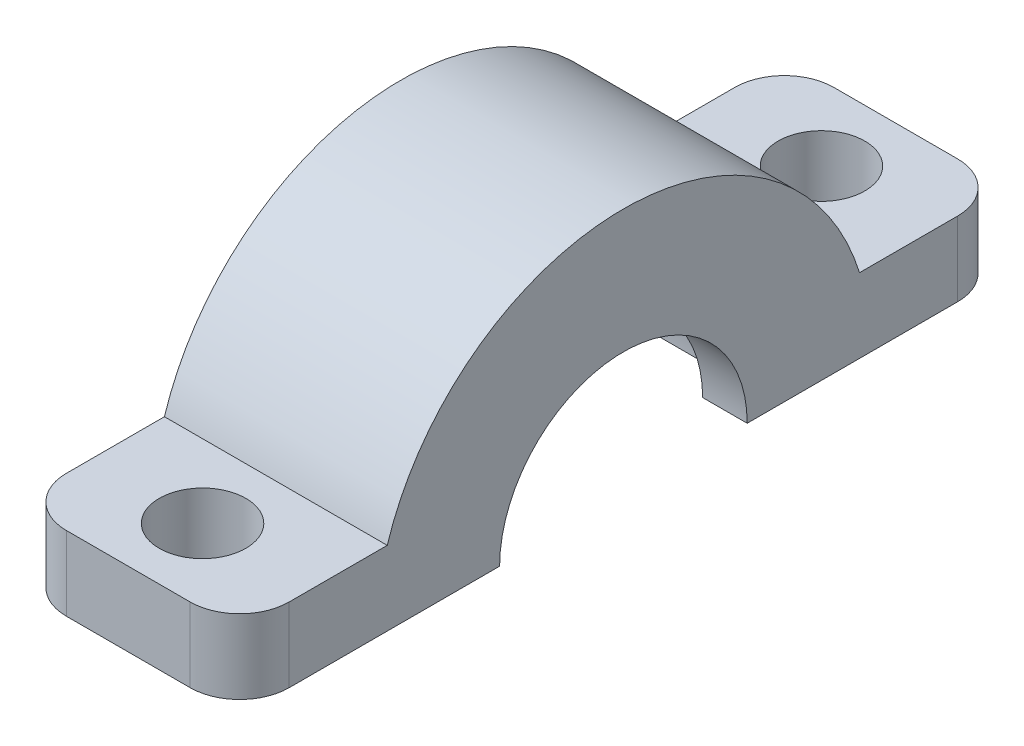
ISO-10303-21;
HEADER;
FILE_DESCRIPTION(('STEP AP214'),'2;1');
FILE_NAME('part.step','',(''),(''),'','','');
FILE_SCHEMA(('AUTOMOTIVE_DESIGN { 1 0 10303 214 1 1 1 1 }'));
ENDSEC;
DATA;
#1=APPLICATION_CONTEXT('core data for automotive mechanical design processes');
#2=APPLICATION_PROTOCOL_DEFINITION('international standard','automotive_design',2000,#1);
#3=PRODUCT_CONTEXT('',#1,'mechanical');
#4=PRODUCT('Part','Part','',(#3));
#5=PRODUCT_RELATED_PRODUCT_CATEGORY('part','',(#4));
#6=PRODUCT_DEFINITION_FORMATION('','',#4);
#7=PRODUCT_DEFINITION_CONTEXT('part definition',#1,'design');
#8=PRODUCT_DEFINITION('design','',#6,#7);
#9=PRODUCT_DEFINITION_SHAPE('','',#8);
#10=(LENGTH_UNIT() NAMED_UNIT(*) SI_UNIT(.MILLI.,.METRE.));
#11=(NAMED_UNIT(*) PLANE_ANGLE_UNIT() SI_UNIT($,.RADIAN.));
#12=(NAMED_UNIT(*) SI_UNIT($,.STERADIAN.) SOLID_ANGLE_UNIT());
#13=UNCERTAINTY_MEASURE_WITH_UNIT(LENGTH_MEASURE(1.E-05),#10,'distance_accuracy_value','');
#14=(GEOMETRIC_REPRESENTATION_CONTEXT(3) GLOBAL_UNCERTAINTY_ASSIGNED_CONTEXT((#13)) GLOBAL_UNIT_ASSIGNED_CONTEXT((#10,
#11,#12)) REPRESENTATION_CONTEXT('',''));
#15=CARTESIAN_POINT('',(0.,0.,0.));
#16=DIRECTION('',(0.,0.,1.));
#17=DIRECTION('',(1.,0.,0.));
#18=AXIS2_PLACEMENT_3D('',#15,#16,#17);
#19=CARTESIAN_POINT('',(-4.5,-1.5,0.));
#20=DIRECTION('',(1.,0.,0.));
#21=DIRECTION('',(0.,0.,-1.));
#22=AXIS2_PLACEMENT_3D('',#19,#20,#21);
#23=CYLINDRICAL_SURFACE('',#22,5.);
#24=DIRECTION('',(1.,0.,0.));
#25=VECTOR('',#24,1.);
#26=CARTESIAN_POINT('',(-4.5,-1.5,-5.));
#27=LINE('',#26,#25);
#28=CARTESIAN_POINT('',(-4.5,-1.5,-5.));
#29=VERTEX_POINT('',#28);
#30=CARTESIAN_POINT('',(-2.7,-1.5,-5.));
#31=VERTEX_POINT('',#30);
#32=EDGE_CURVE('E249',#29,#31,#27,.T.);
#33=ORIENTED_EDGE('',*,*,#32,.T.);
#34=CARTESIAN_POINT('',(-2.7,-1.5,0.));
#35=DIRECTION('',(1.,0.,0.));
#36=DIRECTION('',(0.,0.,-1.));
#37=AXIS2_PLACEMENT_3D('',#34,#35,#36);
#38=CIRCLE('',#37,5.);
#39=CARTESIAN_POINT('',(-2.7,-1.5,5.));
#40=VERTEX_POINT('',#39);
#41=EDGE_CURVE('E159',#31,#40,#38,.T.);
#42=ORIENTED_EDGE('',*,*,#41,.T.);
#43=DIRECTION('',(1.,0.,0.));
#44=VECTOR('',#43,1.);
#45=CARTESIAN_POINT('',(-4.5,-1.5,5.));
#46=LINE('',#45,#44);
#47=CARTESIAN_POINT('',(-4.5,-1.5,5.));
#48=VERTEX_POINT('',#47);
#49=EDGE_CURVE('E254',#48,#40,#46,.T.);
#50=ORIENTED_EDGE('',*,*,#49,.F.);
#51=CARTESIAN_POINT('',(-4.5,-1.5,0.));
#52=DIRECTION('',(-1.,0.,0.));
#53=DIRECTION('',(0.,0.,-1.));
#54=AXIS2_PLACEMENT_3D('',#51,#52,#53);
#55=CIRCLE('',#54,5.);
#56=EDGE_CURVE('E244',#48,#29,#55,.T.);
#57=ORIENTED_EDGE('',*,*,#56,.T.);
#58=EDGE_LOOP('',(#33,#42,#50,#57));
#59=FACE_BOUND('',#58,.T.);
#60=ADVANCED_FACE('F43',(#59),#23,.F.);
#61=CARTESIAN_POINT('',(-4.5,-1.5,-5.));
#62=DIRECTION('',(0.,-1.,0.));
#63=DIRECTION('',(0.,0.,-1.));
#64=AXIS2_PLACEMENT_3D('',#61,#62,#63);
#65=PLANE('',#64);
#66=DIRECTION('',(0.,0.,1.));
#67=VECTOR('',#66,1.);
#68=CARTESIAN_POINT('',(2.7,-1.5,-5.));
#69=LINE('',#68,#67);
#70=CARTESIAN_POINT('',(2.7,-1.5,-6.25));
#71=VERTEX_POINT('',#70);
#72=CARTESIAN_POINT('',(2.7,-1.5,-5.));
#73=VERTEX_POINT('',#72);
#74=EDGE_CURVE('E180',#71,#73,#69,.T.);
#75=ORIENTED_EDGE('',*,*,#74,.F.);
#76=DIRECTION('',(-1.,0.,0.));
#77=VECTOR('',#76,1.);
#78=CARTESIAN_POINT('',(2.7,-1.5,-6.25));
#79=LINE('',#78,#77);
#80=CARTESIAN_POINT('',(-2.7,-1.5,-6.25));
#81=VERTEX_POINT('',#80);
#82=EDGE_CURVE('E169',#71,#81,#79,.T.);
#83=ORIENTED_EDGE('',*,*,#82,.T.);
#84=DIRECTION('',(0.,0.,1.));
#85=VECTOR('',#84,1.);
#86=CARTESIAN_POINT('',(-2.7,-1.5,-5.));
#87=LINE('',#86,#85);
#88=EDGE_CURVE('E156',#81,#31,#87,.T.);
#89=ORIENTED_EDGE('',*,*,#88,.T.);
#90=ORIENTED_EDGE('',*,*,#32,.F.);
#91=DIRECTION('',(0.,0.,-1.));
#92=VECTOR('',#91,1.);
#93=CARTESIAN_POINT('',(-4.5,-1.5,-5.));
#94=LINE('',#93,#92);
#95=CARTESIAN_POINT('',(-4.5,-1.5,-13.5));
#96=VERTEX_POINT('',#95);
#97=EDGE_CURVE('E226',#29,#96,#94,.T.);
#98=ORIENTED_EDGE('',*,*,#97,.T.);
#99=CARTESIAN_POINT('',(-2.5,-1.5,-13.5));
#100=DIRECTION('',(0.,-1.,0.));
#101=DIRECTION('',(0.,0.,-1.));
#102=AXIS2_PLACEMENT_3D('',#99,#100,#101);
#103=CIRCLE('',#102,2.);
#104=CARTESIAN_POINT('',(-2.5,-1.5,-15.5));
#105=VERTEX_POINT('',#104);
#106=EDGE_CURVE('E323',#96,#105,#103,.T.);
#107=ORIENTED_EDGE('',*,*,#106,.T.);
#108=DIRECTION('',(1.,0.,0.));
#109=VECTOR('',#108,1.);
#110=CARTESIAN_POINT('',(-4.5,-1.5,-15.5));
#111=LINE('',#110,#109);
#112=CARTESIAN_POINT('',(2.5,-1.5,-15.5));
#113=VERTEX_POINT('',#112);
#114=EDGE_CURVE('E248',#105,#113,#111,.T.);
#115=ORIENTED_EDGE('',*,*,#114,.T.);
#116=CARTESIAN_POINT('',(2.5,-1.5,-13.5));
#117=DIRECTION('',(0.,-1.,0.));
#118=DIRECTION('',(0.,0.,-1.));
#119=AXIS2_PLACEMENT_3D('',#116,#117,#118);
#120=CIRCLE('',#119,2.);
#121=CARTESIAN_POINT('',(4.5,-1.5,-13.5));
#122=VERTEX_POINT('',#121);
#123=EDGE_CURVE('E326',#113,#122,#120,.T.);
#124=ORIENTED_EDGE('',*,*,#123,.T.);
#125=DIRECTION('',(0.,0.,-1.));
#126=VECTOR('',#125,1.);
#127=CARTESIAN_POINT('',(4.5,-1.5,-5.));
#128=LINE('',#127,#126);
#129=CARTESIAN_POINT('',(4.5,-1.5,-5.));
#130=VERTEX_POINT('',#129);
#131=EDGE_CURVE('E196',#130,#122,#128,.T.);
#132=ORIENTED_EDGE('',*,*,#131,.F.);
#133=EDGE_CURVE('E253',#73,#130,#27,.T.);
#134=ORIENTED_EDGE('',*,*,#133,.F.);
#135=EDGE_LOOP('',(#75,#83,#89,#90,#98,#107,#115,#124,#132,#134));
#136=FACE_BOUND('',#135,.T.);
#137=CARTESIAN_POINT('',(0.,-1.5,-12.5));
#138=DIRECTION('',(0.,1.,0.));
#139=DIRECTION('',(0.,0.,1.));
#140=AXIS2_PLACEMENT_3D('',#137,#138,#139);
#141=CIRCLE('',#140,1.75);
#142=CARTESIAN_POINT('',(0.,-1.5,-10.75));
#143=VERTEX_POINT('',#142);
#144=EDGE_CURVE('E192',#143,#143,#141,.T.);
#145=ORIENTED_EDGE('',*,*,#144,.T.);
#146=EDGE_LOOP('',(#145));
#147=FACE_BOUND('',#146,.T.);
#148=ADVANCED_FACE('F177',(#136,#147),#65,.T.);
#149=CARTESIAN_POINT('',(2.7,-1.5,0.));
#150=DIRECTION('',(1.,0.,0.));
#151=DIRECTION('',(0.,0.,-1.));
#152=AXIS2_PLACEMENT_3D('',#149,#150,#151);
#153=CIRCLE('',#152,5.);
#154=CARTESIAN_POINT('',(2.7,-1.5,5.));
#155=VERTEX_POINT('',#154);
#156=EDGE_CURVE('E164',#73,#155,#153,.T.);
#157=ORIENTED_EDGE('',*,*,#156,.F.);
#158=ORIENTED_EDGE('',*,*,#133,.T.);
#159=CARTESIAN_POINT('',(4.5,-1.5,0.));
#160=DIRECTION('',(-1.,0.,0.));
#161=DIRECTION('',(0.,0.,-1.));
#162=AXIS2_PLACEMENT_3D('',#159,#160,#161);
#163=CIRCLE('',#162,5.);
#164=CARTESIAN_POINT('',(4.5,-1.5,5.));
#165=VERTEX_POINT('',#164);
#166=EDGE_CURVE('E222',#165,#130,#163,.T.);
#167=ORIENTED_EDGE('',*,*,#166,.F.);
#168=EDGE_CURVE('E258',#155,#165,#46,.T.);
#169=ORIENTED_EDGE('',*,*,#168,.F.);
#170=EDGE_LOOP('',(#157,#158,#167,#169));
#171=FACE_BOUND('',#170,.T.);
#172=ADVANCED_FACE('F349',(#171),#23,.F.);
#173=CARTESIAN_POINT('',(-4.5,-1.5,15.5));
#174=DIRECTION('',(0.,-1.,0.));
#175=DIRECTION('',(0.,0.,-1.));
#176=AXIS2_PLACEMENT_3D('',#173,#174,#175);
#177=PLANE('',#176);
#178=DIRECTION('',(0.,0.,1.));
#179=VECTOR('',#178,1.);
#180=CARTESIAN_POINT('',(2.7,-1.5,15.5));
#181=LINE('',#180,#179);
#182=CARTESIAN_POINT('',(2.7,-1.5,6.25));
#183=VERTEX_POINT('',#182);
#184=EDGE_CURVE('E11',#155,#183,#181,.T.);
#185=ORIENTED_EDGE('',*,*,#184,.F.);
#186=ORIENTED_EDGE('',*,*,#168,.T.);
#187=DIRECTION('',(0.,0.,-1.));
#188=VECTOR('',#187,1.);
#189=CARTESIAN_POINT('',(4.5,-1.5,15.5));
#190=LINE('',#189,#188);
#191=CARTESIAN_POINT('',(4.5,-1.5,13.5));
#192=VERTEX_POINT('',#191);
#193=EDGE_CURVE('E218',#192,#165,#190,.T.);
#194=ORIENTED_EDGE('',*,*,#193,.F.);
#195=CARTESIAN_POINT('',(2.5,-1.5,13.5));
#196=DIRECTION('',(0.,-1.,0.));
#197=DIRECTION('',(0.,0.,-1.));
#198=AXIS2_PLACEMENT_3D('',#195,#196,#197);
#199=CIRCLE('',#198,2.);
#200=CARTESIAN_POINT('',(2.5,-1.5,15.5));
#201=VERTEX_POINT('',#200);
#202=EDGE_CURVE('E289',#192,#201,#199,.T.);
#203=ORIENTED_EDGE('',*,*,#202,.T.);
#204=DIRECTION('',(1.,0.,0.));
#205=VECTOR('',#204,1.);
#206=CARTESIAN_POINT('',(-4.5,-1.5,15.5));
#207=LINE('',#206,#205);
#208=CARTESIAN_POINT('',(-2.5,-1.5,15.5));
#209=VERTEX_POINT('',#208);
#210=EDGE_CURVE('E259',#209,#201,#207,.T.);
#211=ORIENTED_EDGE('',*,*,#210,.F.);
#212=CARTESIAN_POINT('',(-2.5,-1.5,13.5));
#213=DIRECTION('',(0.,-1.,0.));
#214=DIRECTION('',(0.,0.,-1.));
#215=AXIS2_PLACEMENT_3D('',#212,#213,#214);
#216=CIRCLE('',#215,2.);
#217=CARTESIAN_POINT('',(-4.5,-1.5,13.5));
#218=VERTEX_POINT('',#217);
#219=EDGE_CURVE('E286',#209,#218,#216,.T.);
#220=ORIENTED_EDGE('',*,*,#219,.T.);
#221=DIRECTION('',(0.,0.,-1.));
#222=VECTOR('',#221,1.);
#223=CARTESIAN_POINT('',(-4.5,-1.5,15.5));
#224=LINE('',#223,#222);
#225=EDGE_CURVE('E241',#218,#48,#224,.T.);
#226=ORIENTED_EDGE('',*,*,#225,.T.);
#227=ORIENTED_EDGE('',*,*,#49,.T.);
#228=DIRECTION('',(0.,0.,1.));
#229=VECTOR('',#228,1.);
#230=CARTESIAN_POINT('',(-2.7,-1.5,15.5));
#231=LINE('',#230,#229);
#232=CARTESIAN_POINT('',(-2.7,-1.5,6.25));
#233=VERTEX_POINT('',#232);
#234=EDGE_CURVE('E329',#40,#233,#231,.T.);
#235=ORIENTED_EDGE('',*,*,#234,.T.);
#236=DIRECTION('',(-1.,0.,0.));
#237=VECTOR('',#236,1.);
#238=CARTESIAN_POINT('',(2.7,-1.5,6.25));
#239=LINE('',#238,#237);
#240=EDGE_CURVE('E52',#233,#183,#239,.F.);
#241=ORIENTED_EDGE('',*,*,#240,.T.);
#242=EDGE_LOOP('',(#185,#186,#194,#203,#211,#220,#226,#227,#235,#241));
#243=FACE_BOUND('',#242,.T.);
#244=CARTESIAN_POINT('',(0.,-1.5,12.5));
#245=DIRECTION('',(0.,1.,0.));
#246=DIRECTION('',(0.,0.,1.));
#247=AXIS2_PLACEMENT_3D('',#244,#245,#246);
#248=CIRCLE('',#247,1.75);
#249=CARTESIAN_POINT('',(0.,-1.5,14.25));
#250=VERTEX_POINT('',#249);
#251=EDGE_CURVE('E182',#250,#250,#248,.T.);
#252=ORIENTED_EDGE('',*,*,#251,.T.);
#253=EDGE_LOOP('',(#252));
#254=FACE_BOUND('',#253,.T.);
#255=ADVANCED_FACE('F334',(#243,#254),#177,.T.);
#256=CARTESIAN_POINT('',(-4.5,1.5,15.5));
#257=DIRECTION('',(0.,0.,1.));
#258=DIRECTION('',(1.,0.,0.));
#259=AXIS2_PLACEMENT_3D('',#256,#257,#258);
#260=PLANE('',#259);
#261=ORIENTED_EDGE('',*,*,#210,.T.);
#262=DIRECTION('',(0.,-1.,0.));
#263=VECTOR('',#262,1.);
#264=CARTESIAN_POINT('',(2.5,1.5,15.5));
#265=LINE('',#264,#263);
#266=CARTESIAN_POINT('',(2.5,1.5,15.5));
#267=VERTEX_POINT('',#266);
#268=EDGE_CURVE('E296',#201,#267,#265,.F.);
#269=ORIENTED_EDGE('',*,*,#268,.T.);
#270=DIRECTION('',(1.,0.,0.));
#271=VECTOR('',#270,1.);
#272=CARTESIAN_POINT('',(-4.5,1.5,15.5));
#273=LINE('',#272,#271);
#274=CARTESIAN_POINT('',(-2.5,1.5,15.5));
#275=VERTEX_POINT('',#274);
#276=EDGE_CURVE('E263',#275,#267,#273,.T.);
#277=ORIENTED_EDGE('',*,*,#276,.F.);
#278=DIRECTION('',(0.,-1.,0.));
#279=VECTOR('',#278,1.);
#280=CARTESIAN_POINT('',(-2.5,-1.5,15.5));
#281=LINE('',#280,#279);
#282=EDGE_CURVE('E292',#275,#209,#281,.T.);
#283=ORIENTED_EDGE('',*,*,#282,.T.);
#284=EDGE_LOOP('',(#261,#269,#277,#283));
#285=FACE_BOUND('',#284,.T.);
#286=ADVANCED_FACE('F365',(#285),#260,.T.);
#287=CARTESIAN_POINT('',(-4.5,1.5,15.5));
#288=DIRECTION('',(0.,1.,0.));
#289=DIRECTION('',(0.,0.,1.));
#290=AXIS2_PLACEMENT_3D('',#287,#288,#289);
#291=PLANE('',#290);
#292=CARTESIAN_POINT('',(0.,1.5,12.5));
#293=DIRECTION('',(0.,1.,0.));
#294=DIRECTION('',(0.,0.,1.));
#295=AXIS2_PLACEMENT_3D('',#292,#293,#294);
#296=CIRCLE('',#295,1.75);
#297=CARTESIAN_POINT('',(0.,1.5,14.25));
#298=VERTEX_POINT('',#297);
#299=EDGE_CURVE('E187',#298,#298,#296,.T.);
#300=ORIENTED_EDGE('',*,*,#299,.F.);
#301=EDGE_LOOP('',(#300));
#302=FACE_BOUND('',#301,.T.);
#303=ORIENTED_EDGE('',*,*,#276,.T.);
#304=CARTESIAN_POINT('',(2.5,1.5,13.5));
#305=DIRECTION('',(0.,1.,0.));
#306=DIRECTION('',(0.,0.,1.));
#307=AXIS2_PLACEMENT_3D('',#304,#305,#306);
#308=CIRCLE('',#307,2.);
#309=CARTESIAN_POINT('',(4.5,1.5,13.5));
#310=VERTEX_POINT('',#309);
#311=EDGE_CURVE('E302',#267,#310,#308,.T.);
#312=ORIENTED_EDGE('',*,*,#311,.T.);
#313=DIRECTION('',(0.,0.,1.));
#314=VECTOR('',#313,1.);
#315=CARTESIAN_POINT('',(4.5,1.5,15.5));
#316=LINE('',#315,#314);
#317=CARTESIAN_POINT('',(4.5,1.5,9.53939201416946));
#318=VERTEX_POINT('',#317);
#319=EDGE_CURVE('E214',#318,#310,#316,.T.);
#320=ORIENTED_EDGE('',*,*,#319,.F.);
#321=DIRECTION('',(1.,0.,0.));
#322=VECTOR('',#321,1.);
#323=CARTESIAN_POINT('',(-4.5,1.5,9.53939201416946));
#324=LINE('',#323,#322);
#325=CARTESIAN_POINT('',(-4.5,1.5,9.53939201416946));
#326=VERTEX_POINT('',#325);
#327=EDGE_CURVE('E267',#326,#318,#324,.T.);
#328=ORIENTED_EDGE('',*,*,#327,.F.);
#329=DIRECTION('',(0.,0.,1.));
#330=VECTOR('',#329,1.);
#331=CARTESIAN_POINT('',(-4.5,1.5,15.5));
#332=LINE('',#331,#330);
#333=CARTESIAN_POINT('',(-4.5,1.5,13.5));
#334=VERTEX_POINT('',#333);
#335=EDGE_CURVE('E237',#326,#334,#332,.T.);
#336=ORIENTED_EDGE('',*,*,#335,.T.);
#337=CARTESIAN_POINT('',(-2.5,1.5,13.5));
#338=DIRECTION('',(0.,1.,0.));
#339=DIRECTION('',(0.,0.,1.));
#340=AXIS2_PLACEMENT_3D('',#337,#338,#339);
#341=CIRCLE('',#340,2.);
#342=EDGE_CURVE('E299',#334,#275,#341,.T.);
#343=ORIENTED_EDGE('',*,*,#342,.T.);
#344=EDGE_LOOP('',(#303,#312,#320,#328,#336,#343));
#345=FACE_BOUND('',#344,.T.);
#346=ADVANCED_FACE('F397',(#302,#345),#291,.T.);
#347=CARTESIAN_POINT('',(-4.5,-1.5,0.));
#348=DIRECTION('',(1.,0.,0.));
#349=DIRECTION('',(0.,0.,-1.));
#350=AXIS2_PLACEMENT_3D('',#347,#348,#349);
#351=CYLINDRICAL_SURFACE('',#350,10.);
#352=ORIENTED_EDGE('',*,*,#327,.T.);
#353=CARTESIAN_POINT('',(4.5,-1.5,0.));
#354=DIRECTION('',(1.,0.,0.));
#355=DIRECTION('',(0.,0.,-1.));
#356=AXIS2_PLACEMENT_3D('',#353,#354,#355);
#357=CIRCLE('',#356,10.);
#358=CARTESIAN_POINT('',(4.5,1.5,-9.53939201416946));
#359=VERTEX_POINT('',#358);
#360=EDGE_CURVE('E210',#359,#318,#357,.T.);
#361=ORIENTED_EDGE('',*,*,#360,.F.);
#362=DIRECTION('',(1.,0.,0.));
#363=VECTOR('',#362,1.);
#364=CARTESIAN_POINT('',(-4.5,1.5,-9.53939201416946));
#365=LINE('',#364,#363);
#366=CARTESIAN_POINT('',(-4.5,1.5,-9.53939201416946));
#367=VERTEX_POINT('',#366);
#368=EDGE_CURVE('E270',#367,#359,#365,.T.);
#369=ORIENTED_EDGE('',*,*,#368,.F.);
#370=CARTESIAN_POINT('',(-4.5,-1.5,0.));
#371=DIRECTION('',(1.,0.,0.));
#372=DIRECTION('',(0.,0.,-1.));
#373=AXIS2_PLACEMENT_3D('',#370,#371,#372);
#374=CIRCLE('',#373,10.);
#375=EDGE_CURVE('E233',#367,#326,#374,.T.);
#376=ORIENTED_EDGE('',*,*,#375,.T.);
#377=EDGE_LOOP('',(#352,#361,#369,#376));
#378=FACE_BOUND('',#377,.T.);
#379=ADVANCED_FACE('F395',(#378),#351,.T.);
#380=CARTESIAN_POINT('',(-4.5,1.5,-9.53939201416946));
#381=DIRECTION('',(0.,1.,0.));
#382=DIRECTION('',(0.,0.,1.));
#383=AXIS2_PLACEMENT_3D('',#380,#381,#382);
#384=PLANE('',#383);
#385=CARTESIAN_POINT('',(0.,1.5,-12.5));
#386=DIRECTION('',(0.,1.,0.));
#387=DIRECTION('',(0.,0.,1.));
#388=AXIS2_PLACEMENT_3D('',#385,#386,#387);
#389=CIRCLE('',#388,1.75);
#390=CARTESIAN_POINT('',(0.,1.5,-10.75));
#391=VERTEX_POINT('',#390);
#392=EDGE_CURVE('E197',#391,#391,#389,.T.);
#393=ORIENTED_EDGE('',*,*,#392,.F.);
#394=EDGE_LOOP('',(#393));
#395=FACE_BOUND('',#394,.T.);
#396=DIRECTION('',(0.,0.,1.));
#397=VECTOR('',#396,1.);
#398=CARTESIAN_POINT('',(4.5,1.5,-9.53939201416946));
#399=LINE('',#398,#397);
#400=CARTESIAN_POINT('',(4.5,1.5,-13.5));
#401=VERTEX_POINT('',#400);
#402=EDGE_CURVE('E207',#401,#359,#399,.T.);
#403=ORIENTED_EDGE('',*,*,#402,.F.);
#404=CARTESIAN_POINT('',(2.5,1.5,-13.5));
#405=DIRECTION('',(0.,1.,0.));
#406=DIRECTION('',(0.,0.,1.));
#407=AXIS2_PLACEMENT_3D('',#404,#405,#406);
#408=CIRCLE('',#407,2.);
#409=CARTESIAN_POINT('',(2.5,1.5,-15.5));
#410=VERTEX_POINT('',#409);
#411=EDGE_CURVE('E314',#401,#410,#408,.T.);
#412=ORIENTED_EDGE('',*,*,#411,.T.);
#413=DIRECTION('',(1.,0.,0.));
#414=VECTOR('',#413,1.);
#415=CARTESIAN_POINT('',(-4.5,1.5,-15.5));
#416=LINE('',#415,#414);
#417=CARTESIAN_POINT('',(-2.5,1.5,-15.5));
#418=VERTEX_POINT('',#417);
#419=EDGE_CURVE('E274',#418,#410,#416,.T.);
#420=ORIENTED_EDGE('',*,*,#419,.F.);
#421=CARTESIAN_POINT('',(-2.5,1.5,-13.5));
#422=DIRECTION('',(0.,1.,0.));
#423=DIRECTION('',(0.,0.,1.));
#424=AXIS2_PLACEMENT_3D('',#421,#422,#423);
#425=CIRCLE('',#424,2.);
#426=CARTESIAN_POINT('',(-4.5,1.5,-13.5));
#427=VERTEX_POINT('',#426);
#428=EDGE_CURVE('E311',#418,#427,#425,.T.);
#429=ORIENTED_EDGE('',*,*,#428,.T.);
#430=DIRECTION('',(0.,0.,1.));
#431=VECTOR('',#430,1.);
#432=CARTESIAN_POINT('',(-4.5,1.5,-9.53939201416946));
#433=LINE('',#432,#431);
#434=EDGE_CURVE('E230',#427,#367,#433,.T.);
#435=ORIENTED_EDGE('',*,*,#434,.T.);
#436=ORIENTED_EDGE('',*,*,#368,.T.);
#437=EDGE_LOOP('',(#403,#412,#420,#429,#435,#436));
#438=FACE_BOUND('',#437,.T.);
#439=ADVANCED_FACE('F386',(#395,#438),#384,.T.);
#440=CARTESIAN_POINT('',(-4.5,1.5,-15.5));
#441=DIRECTION('',(0.,0.,-1.));
#442=DIRECTION('',(-1.,0.,0.));
#443=AXIS2_PLACEMENT_3D('',#440,#441,#442);
#444=PLANE('',#443);
#445=ORIENTED_EDGE('',*,*,#419,.T.);
#446=DIRECTION('',(0.,1.,0.));
#447=VECTOR('',#446,1.);
#448=CARTESIAN_POINT('',(2.5,1.5,-15.5));
#449=LINE('',#448,#447);
#450=EDGE_CURVE('E67',#410,#113,#449,.F.);
#451=ORIENTED_EDGE('',*,*,#450,.T.);
#452=ORIENTED_EDGE('',*,*,#114,.F.);
#453=DIRECTION('',(0.,1.,0.));
#454=VECTOR('',#453,1.);
#455=CARTESIAN_POINT('',(-2.5,1.5,-15.5));
#456=LINE('',#455,#454);
#457=EDGE_CURVE('E317',#105,#418,#456,.T.);
#458=ORIENTED_EDGE('',*,*,#457,.T.);
#459=EDGE_LOOP('',(#445,#451,#452,#458));
#460=FACE_BOUND('',#459,.T.);
#461=ADVANCED_FACE('F383',(#460),#444,.T.);
#462=CARTESIAN_POINT('',(-4.5,-1.5,0.));
#463=DIRECTION('',(1.,0.,0.));
#464=DIRECTION('',(0.,0.,-1.));
#465=AXIS2_PLACEMENT_3D('',#462,#463,#464);
#466=PLANE('',#465);
#467=ORIENTED_EDGE('',*,*,#225,.F.);
#468=DIRECTION('',(0.,-1.,0.));
#469=VECTOR('',#468,1.);
#470=CARTESIAN_POINT('',(-4.5,1.5,13.5));
#471=LINE('',#470,#469);
#472=EDGE_CURVE('E308',#218,#334,#471,.F.);
#473=ORIENTED_EDGE('',*,*,#472,.T.);
#474=ORIENTED_EDGE('',*,*,#335,.F.);
#475=ORIENTED_EDGE('',*,*,#375,.F.);
#476=ORIENTED_EDGE('',*,*,#434,.F.);
#477=DIRECTION('',(0.,1.,0.));
#478=VECTOR('',#477,1.);
#479=CARTESIAN_POINT('',(-4.5,-1.5,-13.5));
#480=LINE('',#479,#478);
#481=EDGE_CURVE('E305',#427,#96,#480,.F.);
#482=ORIENTED_EDGE('',*,*,#481,.T.);
#483=ORIENTED_EDGE('',*,*,#97,.F.);
#484=ORIENTED_EDGE('',*,*,#56,.F.);
#485=EDGE_LOOP('',(#467,#473,#474,#475,#476,#482,#483,#484));
#486=FACE_BOUND('',#485,.T.);
#487=ADVANCED_FACE('F374',(#486),#466,.F.);
#488=CARTESIAN_POINT('',(4.5,-1.5,0.));
#489=DIRECTION('',(1.,0.,0.));
#490=DIRECTION('',(0.,0.,-1.));
#491=AXIS2_PLACEMENT_3D('',#488,#489,#490);
#492=PLANE('',#491);
#493=ORIENTED_EDGE('',*,*,#319,.T.);
#494=DIRECTION('',(0.,-1.,0.));
#495=VECTOR('',#494,1.);
#496=CARTESIAN_POINT('',(4.5,-1.5,13.5));
#497=LINE('',#496,#495);
#498=EDGE_CURVE('E282',#310,#192,#497,.T.);
#499=ORIENTED_EDGE('',*,*,#498,.T.);
#500=ORIENTED_EDGE('',*,*,#193,.T.);
#501=ORIENTED_EDGE('',*,*,#166,.T.);
#502=ORIENTED_EDGE('',*,*,#131,.T.);
#503=DIRECTION('',(0.,1.,0.));
#504=VECTOR('',#503,1.);
#505=CARTESIAN_POINT('',(4.5,-1.5,-13.5));
#506=LINE('',#505,#504);
#507=EDGE_CURVE('E252',#122,#401,#506,.T.);
#508=ORIENTED_EDGE('',*,*,#507,.T.);
#509=ORIENTED_EDGE('',*,*,#402,.T.);
#510=ORIENTED_EDGE('',*,*,#360,.T.);
#511=EDGE_LOOP('',(#493,#499,#500,#501,#502,#508,#509,#510));
#512=FACE_BOUND('',#511,.T.);
#513=ADVANCED_FACE('F356',(#512),#492,.T.);
#514=CARTESIAN_POINT('',(0.,-1.5,-12.5));
#515=DIRECTION('',(0.,1.,0.));
#516=DIRECTION('',(0.,0.,1.));
#517=AXIS2_PLACEMENT_3D('',#514,#515,#516);
#518=CYLINDRICAL_SURFACE('',#517,1.75);
#519=ORIENTED_EDGE('',*,*,#144,.F.);
#520=EDGE_LOOP('',(#519));
#521=FACE_BOUND('',#520,.T.);
#522=ORIENTED_EDGE('',*,*,#392,.T.);
#523=EDGE_LOOP('',(#522));
#524=FACE_BOUND('',#523,.T.);
#525=ADVANCED_FACE('F476',(#521,#524),#518,.F.);
#526=CARTESIAN_POINT('',(0.,-1.5,12.5));
#527=DIRECTION('',(0.,1.,0.));
#528=DIRECTION('',(0.,0.,1.));
#529=AXIS2_PLACEMENT_3D('',#526,#527,#528);
#530=CYLINDRICAL_SURFACE('',#529,1.75);
#531=ORIENTED_EDGE('',*,*,#251,.F.);
#532=EDGE_LOOP('',(#531));
#533=FACE_BOUND('',#532,.T.);
#534=ORIENTED_EDGE('',*,*,#299,.T.);
#535=EDGE_LOOP('',(#534));
#536=FACE_BOUND('',#535,.T.);
#537=ADVANCED_FACE('F434',(#533,#536),#530,.F.);
#538=CARTESIAN_POINT('',(2.5,-1.5,13.5));
#539=DIRECTION('',(0.,-1.,0.));
#540=DIRECTION('',(0.,0.,-1.));
#541=AXIS2_PLACEMENT_3D('',#538,#539,#540);
#542=CYLINDRICAL_SURFACE('',#541,2.);
#543=ORIENTED_EDGE('',*,*,#311,.F.);
#544=ORIENTED_EDGE('',*,*,#268,.F.);
#545=ORIENTED_EDGE('',*,*,#202,.F.);
#546=ORIENTED_EDGE('',*,*,#498,.F.);
#547=EDGE_LOOP('',(#543,#544,#545,#546));
#548=FACE_BOUND('',#547,.T.);
#549=ADVANCED_FACE('F361',(#548),#542,.T.);
#550=CARTESIAN_POINT('',(-2.5,1.5,13.5));
#551=DIRECTION('',(0.,1.,0.));
#552=DIRECTION('',(0.,0.,1.));
#553=AXIS2_PLACEMENT_3D('',#550,#551,#552);
#554=CYLINDRICAL_SURFACE('',#553,2.);
#555=ORIENTED_EDGE('',*,*,#342,.F.);
#556=ORIENTED_EDGE('',*,*,#472,.F.);
#557=ORIENTED_EDGE('',*,*,#219,.F.);
#558=ORIENTED_EDGE('',*,*,#282,.F.);
#559=EDGE_LOOP('',(#555,#556,#557,#558));
#560=FACE_BOUND('',#559,.T.);
#561=ADVANCED_FACE('F370',(#560),#554,.T.);
#562=CARTESIAN_POINT('',(2.5,-1.5,-13.5));
#563=DIRECTION('',(0.,1.,0.));
#564=DIRECTION('',(0.,0.,1.));
#565=AXIS2_PLACEMENT_3D('',#562,#563,#564);
#566=CYLINDRICAL_SURFACE('',#565,2.);
#567=ORIENTED_EDGE('',*,*,#123,.F.);
#568=ORIENTED_EDGE('',*,*,#450,.F.);
#569=ORIENTED_EDGE('',*,*,#411,.F.);
#570=ORIENTED_EDGE('',*,*,#507,.F.);
#571=EDGE_LOOP('',(#567,#568,#569,#570));
#572=FACE_BOUND('',#571,.T.);
#573=ADVANCED_FACE('F390',(#572),#566,.T.);
#574=CARTESIAN_POINT('',(-2.5,1.5,-13.5));
#575=DIRECTION('',(0.,-1.,0.));
#576=DIRECTION('',(0.,0.,-1.));
#577=AXIS2_PLACEMENT_3D('',#574,#575,#576);
#578=CYLINDRICAL_SURFACE('',#577,2.);
#579=ORIENTED_EDGE('',*,*,#106,.F.);
#580=ORIENTED_EDGE('',*,*,#481,.F.);
#581=ORIENTED_EDGE('',*,*,#428,.F.);
#582=ORIENTED_EDGE('',*,*,#457,.F.);
#583=EDGE_LOOP('',(#579,#580,#581,#582));
#584=FACE_BOUND('',#583,.T.);
#585=ADVANCED_FACE('F45',(#584),#578,.T.);
#586=CARTESIAN_POINT('',(2.7,-1.5,0.));
#587=DIRECTION('',(-1.,0.,0.));
#588=DIRECTION('',(0.,0.,1.));
#589=AXIS2_PLACEMENT_3D('',#586,#587,#588);
#590=CYLINDRICAL_SURFACE('',#589,6.25);
#591=CARTESIAN_POINT('',(2.7,-1.5,0.));
#592=DIRECTION('',(1.,0.,0.));
#593=DIRECTION('',(0.,0.,-1.));
#594=AXIS2_PLACEMENT_3D('',#591,#592,#593);
#595=CIRCLE('',#594,6.25);
#596=EDGE_CURVE('E174',#71,#183,#595,.T.);
#597=ORIENTED_EDGE('',*,*,#596,.T.);
#598=ORIENTED_EDGE('',*,*,#240,.F.);
#599=CARTESIAN_POINT('',(-2.7,-1.5,0.));
#600=DIRECTION('',(1.,0.,0.));
#601=DIRECTION('',(0.,0.,-1.));
#602=AXIS2_PLACEMENT_3D('',#599,#600,#601);
#603=CIRCLE('',#602,6.25);
#604=EDGE_CURVE('E59',#81,#233,#603,.T.);
#605=ORIENTED_EDGE('',*,*,#604,.F.);
#606=ORIENTED_EDGE('',*,*,#82,.F.);
#607=EDGE_LOOP('',(#597,#598,#605,#606));
#608=FACE_BOUND('',#607,.T.);
#609=ADVANCED_FACE('F168',(#608),#590,.F.);
#610=CARTESIAN_POINT('',(2.7,-1.5,0.));
#611=DIRECTION('',(1.,0.,0.));
#612=DIRECTION('',(0.,0.,-1.));
#613=AXIS2_PLACEMENT_3D('',#610,#611,#612);
#614=PLANE('',#613);
#615=ORIENTED_EDGE('',*,*,#74,.T.);
#616=ORIENTED_EDGE('',*,*,#156,.T.);
#617=ORIENTED_EDGE('',*,*,#184,.T.);
#618=ORIENTED_EDGE('',*,*,#596,.F.);
#619=EDGE_LOOP('',(#615,#616,#617,#618));
#620=FACE_BOUND('',#619,.T.);
#621=ADVANCED_FACE('F347',(#620),#614,.F.);
#622=CARTESIAN_POINT('',(-2.7,-1.5,0.));
#623=DIRECTION('',(1.,0.,0.));
#624=DIRECTION('',(0.,0.,-1.));
#625=AXIS2_PLACEMENT_3D('',#622,#623,#624);
#626=PLANE('',#625);
#627=ORIENTED_EDGE('',*,*,#604,.T.);
#628=ORIENTED_EDGE('',*,*,#234,.F.);
#629=ORIENTED_EDGE('',*,*,#41,.F.);
#630=ORIENTED_EDGE('',*,*,#88,.F.);
#631=EDGE_LOOP('',(#627,#628,#629,#630));
#632=FACE_BOUND('',#631,.T.);
#633=ADVANCED_FACE('F157',(#632),#626,.T.);
#634=CLOSED_SHELL('',(#60,#148,#172,#255,#286,#346,#379,#439,#461,#487,#513,#525,#537,#549,#561,
#573,#585,#609,#621,#633));
#635=MANIFOLD_SOLID_BREP('B2',#634);
#636=ADVANCED_BREP_SHAPE_REPRESENTATION('',(#18,#635),#14);
#637=SHAPE_DEFINITION_REPRESENTATION(#9,#636);
ENDSEC;
END-ISO-10303-21;
